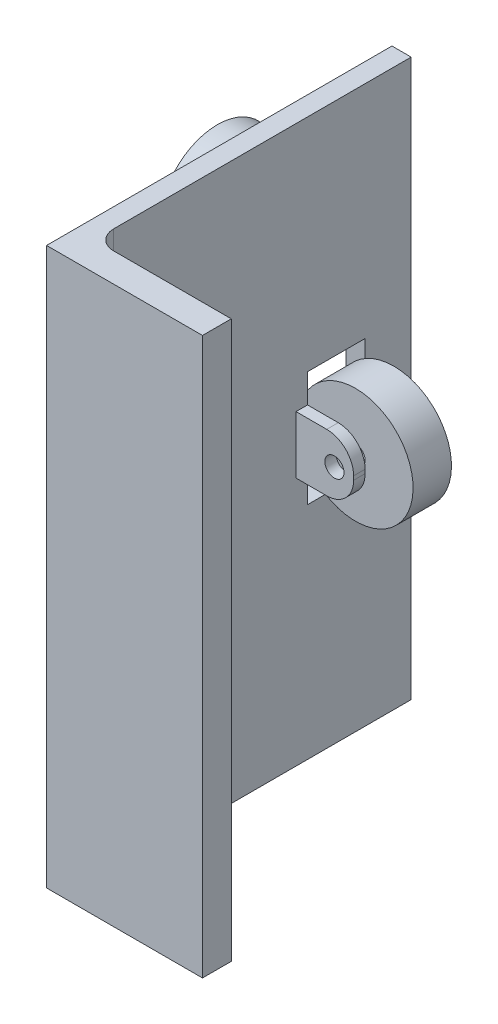
ISO-10303-21;
HEADER;
FILE_DESCRIPTION(('STEP AP214'),'2;1');
FILE_NAME('part.step','',(''),(''),'','','');
FILE_SCHEMA(('AUTOMOTIVE_DESIGN { 1 0 10303 214 1 1 1 1 }'));
ENDSEC;
DATA;
#1=APPLICATION_CONTEXT('core data for automotive mechanical design processes');
#2=APPLICATION_PROTOCOL_DEFINITION('international standard','automotive_design',2000,#1);
#3=PRODUCT_CONTEXT('',#1,'mechanical');
#4=PRODUCT('Part','Part','',(#3));
#5=PRODUCT_RELATED_PRODUCT_CATEGORY('part','',(#4));
#6=PRODUCT_DEFINITION_FORMATION('','',#4);
#7=PRODUCT_DEFINITION_CONTEXT('part definition',#1,'design');
#8=PRODUCT_DEFINITION('design','',#6,#7);
#9=PRODUCT_DEFINITION_SHAPE('','',#8);
#10=(LENGTH_UNIT() NAMED_UNIT(*) SI_UNIT(.MILLI.,.METRE.));
#11=(NAMED_UNIT(*) PLANE_ANGLE_UNIT() SI_UNIT($,.RADIAN.));
#12=(NAMED_UNIT(*) SI_UNIT($,.STERADIAN.) SOLID_ANGLE_UNIT());
#13=UNCERTAINTY_MEASURE_WITH_UNIT(LENGTH_MEASURE(1.E-05),#10,'distance_accuracy_value','');
#14=(GEOMETRIC_REPRESENTATION_CONTEXT(3) GLOBAL_UNCERTAINTY_ASSIGNED_CONTEXT((#13)) GLOBAL_UNIT_ASSIGNED_CONTEXT((#10,
#11,#12)) REPRESENTATION_CONTEXT('',''));
#15=CARTESIAN_POINT('',(0.,0.,0.));
#16=DIRECTION('',(0.,0.,1.));
#17=DIRECTION('',(1.,0.,0.));
#18=AXIS2_PLACEMENT_3D('',#15,#16,#17);
#19=CARTESIAN_POINT('',(15.,72.5,-75.5));
#20=DIRECTION('',(0.,0.,1.));
#21=DIRECTION('',(0.,-1.,0.));
#22=AXIS2_PLACEMENT_3D('',#19,#20,#21);
#23=CYLINDRICAL_SURFACE('',#22,15.);
#24=CARTESIAN_POINT('',(15.,72.5,-75.5));
#25=DIRECTION('',(0.,0.,-1.));
#26=DIRECTION('',(0.,1.,0.));
#27=AXIS2_PLACEMENT_3D('',#24,#25,#26);
#28=CIRCLE('',#27,15.);
#29=CARTESIAN_POINT('',(15.,87.5,-75.5));
#30=VERTEX_POINT('',#29);
#31=EDGE_CURVE('E11',#30,#30,#28,.T.);
#32=ORIENTED_EDGE('',*,*,#31,.F.);
#33=EDGE_LOOP('',(#32));
#34=FACE_BOUND('',#33,.T.);
#35=CARTESIAN_POINT('',(15.,72.5,-65.5));
#36=DIRECTION('',(0.,0.,-1.));
#37=DIRECTION('',(0.,1.,0.));
#38=AXIS2_PLACEMENT_3D('',#35,#36,#37);
#39=CIRCLE('',#38,15.);
#40=CARTESIAN_POINT('',(15.,87.5,-65.5));
#41=VERTEX_POINT('',#40);
#42=EDGE_CURVE('E47',#41,#41,#39,.T.);
#43=ORIENTED_EDGE('',*,*,#42,.T.);
#44=EDGE_LOOP('',(#43));
#45=FACE_BOUND('',#44,.T.);
#46=ADVANCED_FACE('F40',(#34,#45),#23,.T.);
#47=CARTESIAN_POINT('',(15.,72.5,-75.5));
#48=DIRECTION('',(0.,0.,-1.));
#49=DIRECTION('',(0.,1.,0.));
#50=AXIS2_PLACEMENT_3D('',#47,#48,#49);
#51=PLANE('',#50);
#52=CARTESIAN_POINT('',(15.,72.5,-75.5));
#53=DIRECTION('',(0.,0.,-1.));
#54=DIRECTION('',(0.,1.,0.));
#55=AXIS2_PLACEMENT_3D('',#52,#53,#54);
#56=CIRCLE('',#55,2.5);
#57=CARTESIAN_POINT('',(15.,75.,-75.5));
#58=VERTEX_POINT('',#57);
#59=EDGE_CURVE('E52',#58,#58,#56,.T.);
#60=ORIENTED_EDGE('',*,*,#59,.F.);
#61=EDGE_LOOP('',(#60));
#62=FACE_BOUND('',#61,.T.);
#63=ORIENTED_EDGE('',*,*,#31,.T.);
#64=EDGE_LOOP('',(#63));
#65=FACE_BOUND('',#64,.T.);
#66=ADVANCED_FACE('F69',(#62,#65),#51,.T.);
#67=CARTESIAN_POINT('',(15.,72.5,-65.5));
#68=DIRECTION('',(0.,0.,-1.));
#69=DIRECTION('',(0.,1.,0.));
#70=AXIS2_PLACEMENT_3D('',#67,#68,#69);
#71=PLANE('',#70);
#72=CARTESIAN_POINT('',(15.,72.5,-65.5));
#73=DIRECTION('',(0.,0.,-1.));
#74=DIRECTION('',(0.,1.,0.));
#75=AXIS2_PLACEMENT_3D('',#72,#73,#74);
#76=CIRCLE('',#75,2.5);
#77=CARTESIAN_POINT('',(15.,75.,-65.5));
#78=VERTEX_POINT('',#77);
#79=EDGE_CURVE('E43',#78,#78,#76,.T.);
#80=ORIENTED_EDGE('',*,*,#79,.T.);
#81=EDGE_LOOP('',(#80));
#82=FACE_BOUND('',#81,.T.);
#83=ORIENTED_EDGE('',*,*,#42,.F.);
#84=EDGE_LOOP('',(#83));
#85=FACE_BOUND('',#84,.T.);
#86=ADVANCED_FACE('F60',(#82,#85),#71,.F.);
#87=CARTESIAN_POINT('',(15.,72.5,-56.));
#88=DIRECTION('',(0.,0.,-1.));
#89=DIRECTION('',(-1.,0.,0.));
#90=AXIS2_PLACEMENT_3D('',#87,#88,#89);
#91=CYLINDRICAL_SURFACE('',#90,2.5);
#92=ORIENTED_EDGE('',*,*,#59,.T.);
#93=EDGE_LOOP('',(#92));
#94=FACE_BOUND('',#93,.T.);
#95=ORIENTED_EDGE('',*,*,#79,.F.);
#96=EDGE_LOOP('',(#95));
#97=FACE_BOUND('',#96,.T.);
#98=ADVANCED_FACE('F63',(#94,#97),#91,.F.);
#99=CLOSED_SHELL('',(#46,#66,#86,#98));
#100=MANIFOLD_SOLID_BREP('B2',#99);
#101=CARTESIAN_POINT('',(5.,145.,-90.));
#102=DIRECTION('',(-1.,0.,0.));
#103=DIRECTION('',(0.,0.,1.));
#104=AXIS2_PLACEMENT_3D('',#101,#102,#103);
#105=PLANE('',#104);
#106=DIRECTION('',(0.,0.,-1.));
#107=VECTOR('',#106,1.);
#108=CARTESIAN_POINT('',(5.,0.,-90.));
#109=LINE('',#108,#107);
#110=CARTESIAN_POINT('',(5.,0.,-12.5));
#111=VERTEX_POINT('',#110);
#112=CARTESIAN_POINT('',(5.,0.,-90.));
#113=VERTEX_POINT('',#112);
#114=EDGE_CURVE('E379',#111,#113,#109,.T.);
#115=ORIENTED_EDGE('',*,*,#114,.T.);
#116=DIRECTION('',(0.,-1.,0.));
#117=VECTOR('',#116,1.);
#118=CARTESIAN_POINT('',(5.,145.,-90.));
#119=LINE('',#118,#117);
#120=CARTESIAN_POINT('',(5.,145.,-90.));
#121=VERTEX_POINT('',#120);
#122=EDGE_CURVE('E389',#121,#113,#119,.T.);
#123=ORIENTED_EDGE('',*,*,#122,.F.);
#124=DIRECTION('',(0.,0.,-1.));
#125=VECTOR('',#124,1.);
#126=CARTESIAN_POINT('',(5.,145.,-90.));
#127=LINE('',#126,#125);
#128=CARTESIAN_POINT('',(5.,145.,-12.5));
#129=VERTEX_POINT('',#128);
#130=EDGE_CURVE('E364',#129,#121,#127,.T.);
#131=ORIENTED_EDGE('',*,*,#130,.F.);
#132=DIRECTION('',(0.,-1.,0.));
#133=VECTOR('',#132,1.);
#134=CARTESIAN_POINT('',(5.,145.,-12.5));
#135=LINE('',#134,#133);
#136=EDGE_CURVE('E392',#129,#111,#135,.T.);
#137=ORIENTED_EDGE('',*,*,#136,.T.);
#138=EDGE_LOOP('',(#115,#123,#131,#137));
#139=FACE_BOUND('',#138,.T.);
#140=DIRECTION('',(0.,0.,1.));
#141=VECTOR('',#140,1.);
#142=CARTESIAN_POINT('',(5.,80.,-78.));
#143=LINE('',#142,#141);
#144=CARTESIAN_POINT('',(5.,80.,-81.));
#145=VERTEX_POINT('',#144);
#146=CARTESIAN_POINT('',(5.,80.,-78.));
#147=VERTEX_POINT('',#146);
#148=EDGE_CURVE('E283',#145,#147,#143,.T.);
#149=ORIENTED_EDGE('',*,*,#148,.F.);
#150=DIRECTION('',(0.,1.,0.));
#151=VECTOR('',#150,1.);
#152=CARTESIAN_POINT('',(5.,80.,-81.));
#153=LINE('',#152,#151);
#154=CARTESIAN_POINT('',(5.,65.,-81.));
#155=VERTEX_POINT('',#154);
#156=EDGE_CURVE('E282',#155,#145,#153,.T.);
#157=ORIENTED_EDGE('',*,*,#156,.F.);
#158=DIRECTION('',(0.,0.,-1.));
#159=VECTOR('',#158,1.);
#160=CARTESIAN_POINT('',(5.,65.,-78.));
#161=LINE('',#160,#159);
#162=CARTESIAN_POINT('',(5.,65.,-78.));
#163=VERTEX_POINT('',#162);
#164=EDGE_CURVE('E260',#163,#155,#161,.T.);
#165=ORIENTED_EDGE('',*,*,#164,.F.);
#166=DIRECTION('',(0.,-1.,0.));
#167=VECTOR('',#166,1.);
#168=CARTESIAN_POINT('',(5.,145.,-78.0000000000001));
#169=LINE('',#168,#167);
#170=CARTESIAN_POINT('',(5.,57.5,-78.));
#171=VERTEX_POINT('',#170);
#172=EDGE_CURVE('E268',#163,#171,#169,.T.);
#173=ORIENTED_EDGE('',*,*,#172,.T.);
#174=DIRECTION('',(0.,0.,1.));
#175=VECTOR('',#174,1.);
#176=CARTESIAN_POINT('',(5.,57.5,-90.));
#177=LINE('',#176,#175);
#178=CARTESIAN_POINT('',(5.,57.5,-63.));
#179=VERTEX_POINT('',#178);
#180=EDGE_CURVE('E333',#171,#179,#177,.T.);
#181=ORIENTED_EDGE('',*,*,#180,.T.);
#182=DIRECTION('',(0.,1.,0.));
#183=VECTOR('',#182,1.);
#184=CARTESIAN_POINT('',(5.,145.,-63.));
#185=LINE('',#184,#183);
#186=CARTESIAN_POINT('',(5.,65.,-63.));
#187=VERTEX_POINT('',#186);
#188=EDGE_CURVE('E341',#179,#187,#185,.T.);
#189=ORIENTED_EDGE('',*,*,#188,.T.);
#190=DIRECTION('',(0.,0.,-1.));
#191=VECTOR('',#190,1.);
#192=CARTESIAN_POINT('',(5.,65.,-63.));
#193=LINE('',#192,#191);
#194=CARTESIAN_POINT('',(5.,65.,-60.));
#195=VERTEX_POINT('',#194);
#196=EDGE_CURVE('E302',#195,#187,#193,.T.);
#197=ORIENTED_EDGE('',*,*,#196,.F.);
#198=DIRECTION('',(0.,-1.,0.));
#199=VECTOR('',#198,1.);
#200=CARTESIAN_POINT('',(5.,80.,-60.));
#201=LINE('',#200,#199);
#202=CARTESIAN_POINT('',(5.,80.,-60.));
#203=VERTEX_POINT('',#202);
#204=EDGE_CURVE('E308',#203,#195,#201,.T.);
#205=ORIENTED_EDGE('',*,*,#204,.F.);
#206=DIRECTION('',(0.,0.,1.));
#207=VECTOR('',#206,1.);
#208=CARTESIAN_POINT('',(5.,80.,-63.));
#209=LINE('',#208,#207);
#210=CARTESIAN_POINT('',(5.,80.,-63.));
#211=VERTEX_POINT('',#210);
#212=EDGE_CURVE('E297',#211,#203,#209,.T.);
#213=ORIENTED_EDGE('',*,*,#212,.F.);
#214=CARTESIAN_POINT('',(5.,87.5,-63.));
#215=VERTEX_POINT('',#214);
#216=EDGE_CURVE('E340',#211,#215,#185,.T.);
#217=ORIENTED_EDGE('',*,*,#216,.T.);
#218=DIRECTION('',(0.,0.,-1.));
#219=VECTOR('',#218,1.);
#220=CARTESIAN_POINT('',(5.,87.5,-90.));
#221=LINE('',#220,#219);
#222=CARTESIAN_POINT('',(5.,87.5,-78.));
#223=VERTEX_POINT('',#222);
#224=EDGE_CURVE('E277',#215,#223,#221,.T.);
#225=ORIENTED_EDGE('',*,*,#224,.T.);
#226=EDGE_CURVE('E276',#223,#147,#169,.T.);
#227=ORIENTED_EDGE('',*,*,#226,.T.);
#228=EDGE_LOOP('',(#149,#157,#165,#173,#181,#189,#197,#205,#213,#217,#225,#227));
#229=FACE_BOUND('',#228,.T.);
#230=ADVANCED_FACE('F101',(#139,#229),#105,.F.);
#231=CARTESIAN_POINT('',(0.,145.,0.));
#232=DIRECTION('',(0.,0.,-1.));
#233=DIRECTION('',(-1.,0.,0.));
#234=AXIS2_PLACEMENT_3D('',#231,#232,#233);
#235=PLANE('',#234);
#236=DIRECTION('',(1.,0.,0.));
#237=VECTOR('',#236,1.);
#238=CARTESIAN_POINT('',(0.,0.,0.));
#239=LINE('',#238,#237);
#240=CARTESIAN_POINT('',(0.,0.,0.));
#241=VERTEX_POINT('',#240);
#242=CARTESIAN_POINT('',(40.625,0.,0.));
#243=VERTEX_POINT('',#242);
#244=EDGE_CURVE('E353',#241,#243,#239,.T.);
#245=ORIENTED_EDGE('',*,*,#244,.T.);
#246=DIRECTION('',(0.,-1.,0.));
#247=VECTOR('',#246,1.);
#248=CARTESIAN_POINT('',(40.625,145.,0.));
#249=LINE('',#248,#247);
#250=CARTESIAN_POINT('',(40.625,145.,0.));
#251=VERTEX_POINT('',#250);
#252=EDGE_CURVE('E401',#251,#243,#249,.T.);
#253=ORIENTED_EDGE('',*,*,#252,.F.);
#254=DIRECTION('',(1.,0.,0.));
#255=VECTOR('',#254,1.);
#256=CARTESIAN_POINT('',(0.,145.,0.));
#257=LINE('',#256,#255);
#258=CARTESIAN_POINT('',(0.,145.,0.));
#259=VERTEX_POINT('',#258);
#260=EDGE_CURVE('E354',#259,#251,#257,.T.);
#261=ORIENTED_EDGE('',*,*,#260,.F.);
#262=DIRECTION('',(0.,-1.,0.));
#263=VECTOR('',#262,1.);
#264=CARTESIAN_POINT('',(0.,145.,0.));
#265=LINE('',#264,#263);
#266=EDGE_CURVE('E370',#259,#241,#265,.T.);
#267=ORIENTED_EDGE('',*,*,#266,.T.);
#268=EDGE_LOOP('',(#245,#253,#261,#267));
#269=FACE_BOUND('',#268,.T.);
#270=ADVANCED_FACE('F478',(#269),#235,.F.);
#271=CARTESIAN_POINT('',(40.625,145.,0.));
#272=DIRECTION('',(-1.,0.,0.));
#273=DIRECTION('',(0.,0.,1.));
#274=AXIS2_PLACEMENT_3D('',#271,#272,#273);
#275=PLANE('',#274);
#276=DIRECTION('',(0.,0.,-1.));
#277=VECTOR('',#276,1.);
#278=CARTESIAN_POINT('',(40.625,0.,0.));
#279=LINE('',#278,#277);
#280=CARTESIAN_POINT('',(40.625,0.,-7.5));
#281=VERTEX_POINT('',#280);
#282=EDGE_CURVE('E373',#243,#281,#279,.T.);
#283=ORIENTED_EDGE('',*,*,#282,.T.);
#284=DIRECTION('',(0.,-1.,0.));
#285=VECTOR('',#284,1.);
#286=CARTESIAN_POINT('',(40.625,145.,-7.5));
#287=LINE('',#286,#285);
#288=CARTESIAN_POINT('',(40.625,145.,-7.5));
#289=VERTEX_POINT('',#288);
#290=EDGE_CURVE('E398',#289,#281,#287,.T.);
#291=ORIENTED_EDGE('',*,*,#290,.F.);
#292=DIRECTION('',(0.,0.,-1.));
#293=VECTOR('',#292,1.);
#294=CARTESIAN_POINT('',(40.625,145.,0.));
#295=LINE('',#294,#293);
#296=EDGE_CURVE('E357',#251,#289,#295,.T.);
#297=ORIENTED_EDGE('',*,*,#296,.F.);
#298=ORIENTED_EDGE('',*,*,#252,.T.);
#299=EDGE_LOOP('',(#283,#291,#297,#298));
#300=FACE_BOUND('',#299,.T.);
#301=ADVANCED_FACE('F484',(#300),#275,.F.);
#302=CARTESIAN_POINT('',(10.,145.,-7.5));
#303=DIRECTION('',(0.,0.,1.));
#304=DIRECTION('',(1.,0.,0.));
#305=AXIS2_PLACEMENT_3D('',#302,#303,#304);
#306=PLANE('',#305);
#307=DIRECTION('',(-1.,0.,0.));
#308=VECTOR('',#307,1.);
#309=CARTESIAN_POINT('',(10.,0.,-7.5));
#310=LINE('',#309,#308);
#311=CARTESIAN_POINT('',(10.,0.,-7.5));
#312=VERTEX_POINT('',#311);
#313=EDGE_CURVE('E375',#281,#312,#310,.T.);
#314=ORIENTED_EDGE('',*,*,#313,.T.);
#315=DIRECTION('',(0.,-1.,0.));
#316=VECTOR('',#315,1.);
#317=CARTESIAN_POINT('',(10.,145.,-7.5));
#318=LINE('',#317,#316);
#319=CARTESIAN_POINT('',(10.,145.,-7.5));
#320=VERTEX_POINT('',#319);
#321=EDGE_CURVE('E395',#320,#312,#318,.T.);
#322=ORIENTED_EDGE('',*,*,#321,.F.);
#323=DIRECTION('',(-1.,0.,0.));
#324=VECTOR('',#323,1.);
#325=CARTESIAN_POINT('',(10.,145.,-7.5));
#326=LINE('',#325,#324);
#327=EDGE_CURVE('E360',#289,#320,#326,.T.);
#328=ORIENTED_EDGE('',*,*,#327,.F.);
#329=ORIENTED_EDGE('',*,*,#290,.T.);
#330=EDGE_LOOP('',(#314,#322,#328,#329));
#331=FACE_BOUND('',#330,.T.);
#332=ADVANCED_FACE('F494',(#331),#306,.F.);
#333=CARTESIAN_POINT('',(10.,145.,-12.5));
#334=DIRECTION('',(0.,-1.,0.));
#335=DIRECTION('',(0.,0.,-1.));
#336=AXIS2_PLACEMENT_3D('',#333,#334,#335);
#337=CYLINDRICAL_SURFACE('',#336,5.);
#338=CARTESIAN_POINT('',(10.,0.,-12.5));
#339=DIRECTION('',(0.,-1.,0.));
#340=DIRECTION('',(0.,0.,1.));
#341=AXIS2_PLACEMENT_3D('',#338,#339,#340);
#342=CIRCLE('',#341,5.);
#343=EDGE_CURVE('E377',#312,#111,#342,.T.);
#344=ORIENTED_EDGE('',*,*,#343,.T.);
#345=ORIENTED_EDGE('',*,*,#136,.F.);
#346=CARTESIAN_POINT('',(10.,145.,-12.5));
#347=DIRECTION('',(0.,-1.,0.));
#348=DIRECTION('',(0.,0.,1.));
#349=AXIS2_PLACEMENT_3D('',#346,#347,#348);
#350=CIRCLE('',#349,5.);
#351=EDGE_CURVE('E362',#320,#129,#350,.T.);
#352=ORIENTED_EDGE('',*,*,#351,.F.);
#353=ORIENTED_EDGE('',*,*,#321,.T.);
#354=EDGE_LOOP('',(#344,#345,#352,#353));
#355=FACE_BOUND('',#354,.T.);
#356=ADVANCED_FACE('F491',(#355),#337,.F.);
#357=CARTESIAN_POINT('',(0.,145.,-90.));
#358=DIRECTION('',(0.,0.,1.));
#359=DIRECTION('',(1.,0.,0.));
#360=AXIS2_PLACEMENT_3D('',#357,#358,#359);
#361=PLANE('',#360);
#362=DIRECTION('',(-1.,0.,0.));
#363=VECTOR('',#362,1.);
#364=CARTESIAN_POINT('',(0.,0.,-90.));
#365=LINE('',#364,#363);
#366=CARTESIAN_POINT('',(0.,0.,-90.));
#367=VERTEX_POINT('',#366);
#368=EDGE_CURVE('E381',#113,#367,#365,.T.);
#369=ORIENTED_EDGE('',*,*,#368,.T.);
#370=DIRECTION('',(0.,-1.,0.));
#371=VECTOR('',#370,1.);
#372=CARTESIAN_POINT('',(0.,145.,-90.));
#373=LINE('',#372,#371);
#374=CARTESIAN_POINT('',(0.,145.,-90.));
#375=VERTEX_POINT('',#374);
#376=EDGE_CURVE('E386',#375,#367,#373,.T.);
#377=ORIENTED_EDGE('',*,*,#376,.F.);
#378=DIRECTION('',(-1.,0.,0.));
#379=VECTOR('',#378,1.);
#380=CARTESIAN_POINT('',(0.,145.,-90.));
#381=LINE('',#380,#379);
#382=EDGE_CURVE('E366',#121,#375,#381,.T.);
#383=ORIENTED_EDGE('',*,*,#382,.F.);
#384=ORIENTED_EDGE('',*,*,#122,.T.);
#385=EDGE_LOOP('',(#369,#377,#383,#384));
#386=FACE_BOUND('',#385,.T.);
#387=ADVANCED_FACE('F489',(#386),#361,.F.);
#388=CARTESIAN_POINT('',(0.,145.,0.));
#389=DIRECTION('',(1.,0.,0.));
#390=DIRECTION('',(0.,0.,-1.));
#391=AXIS2_PLACEMENT_3D('',#388,#389,#390);
#392=PLANE('',#391);
#393=DIRECTION('',(0.,0.,1.));
#394=VECTOR('',#393,1.);
#395=CARTESIAN_POINT('',(0.,57.5,-78.));
#396=LINE('',#395,#394);
#397=CARTESIAN_POINT('',(0.,57.5,-78.));
#398=VERTEX_POINT('',#397);
#399=CARTESIAN_POINT('',(0.,57.5,-63.));
#400=VERTEX_POINT('',#399);
#401=EDGE_CURVE('E322',#398,#400,#396,.T.);
#402=ORIENTED_EDGE('',*,*,#401,.F.);
#403=DIRECTION('',(0.,-1.,0.));
#404=VECTOR('',#403,1.);
#405=CARTESIAN_POINT('',(0.,87.5,-78.));
#406=LINE('',#405,#404);
#407=CARTESIAN_POINT('',(0.,87.5,-78.));
#408=VERTEX_POINT('',#407);
#409=EDGE_CURVE('E320',#408,#398,#406,.T.);
#410=ORIENTED_EDGE('',*,*,#409,.F.);
#411=DIRECTION('',(0.,0.,-1.));
#412=VECTOR('',#411,1.);
#413=CARTESIAN_POINT('',(0.,87.5,-78.));
#414=LINE('',#413,#412);
#415=CARTESIAN_POINT('',(0.,87.5,-63.));
#416=VERTEX_POINT('',#415);
#417=EDGE_CURVE('E328',#416,#408,#414,.T.);
#418=ORIENTED_EDGE('',*,*,#417,.F.);
#419=DIRECTION('',(0.,1.,0.));
#420=VECTOR('',#419,1.);
#421=CARTESIAN_POINT('',(0.,87.5,-63.));
#422=LINE('',#421,#420);
#423=EDGE_CURVE('E325',#400,#416,#422,.T.);
#424=ORIENTED_EDGE('',*,*,#423,.F.);
#425=EDGE_LOOP('',(#402,#410,#418,#424));
#426=FACE_BOUND('',#425,.T.);
#427=CARTESIAN_POINT('',(0.,20.,-54.5));
#428=DIRECTION('',(1.,0.,0.));
#429=DIRECTION('',(0.,0.,-1.));
#430=AXIS2_PLACEMENT_3D('',#427,#428,#429);
#431=CIRCLE('',#430,15.);
#432=CARTESIAN_POINT('',(0.,20.,-69.5));
#433=VERTEX_POINT('',#432);
#434=EDGE_CURVE('E407',#433,#433,#431,.F.);
#435=ORIENTED_EDGE('',*,*,#434,.F.);
#436=EDGE_LOOP('',(#435));
#437=FACE_BOUND('',#436,.T.);
#438=CARTESIAN_POINT('',(0.,125.,-54.5));
#439=DIRECTION('',(1.,0.,0.));
#440=DIRECTION('',(0.,0.,-1.));
#441=AXIS2_PLACEMENT_3D('',#438,#439,#440);
#442=CIRCLE('',#441,15.);
#443=CARTESIAN_POINT('',(0.,125.,-69.5));
#444=VERTEX_POINT('',#443);
#445=EDGE_CURVE('E404',#444,#444,#442,.F.);
#446=ORIENTED_EDGE('',*,*,#445,.F.);
#447=EDGE_LOOP('',(#446));
#448=FACE_BOUND('',#447,.T.);
#449=DIRECTION('',(0.,0.,1.));
#450=VECTOR('',#449,1.);
#451=CARTESIAN_POINT('',(0.,0.,0.));
#452=LINE('',#451,#450);
#453=EDGE_CURVE('E358',#367,#241,#452,.T.);
#454=ORIENTED_EDGE('',*,*,#453,.T.);
#455=ORIENTED_EDGE('',*,*,#266,.F.);
#456=DIRECTION('',(0.,0.,1.));
#457=VECTOR('',#456,1.);
#458=CARTESIAN_POINT('',(0.,145.,0.));
#459=LINE('',#458,#457);
#460=EDGE_CURVE('E368',#375,#259,#459,.T.);
#461=ORIENTED_EDGE('',*,*,#460,.F.);
#462=ORIENTED_EDGE('',*,*,#376,.T.);
#463=EDGE_LOOP('',(#454,#455,#461,#462));
#464=FACE_BOUND('',#463,.T.);
#465=ADVANCED_FACE('F567',(#426,#437,#448,#464),#392,.F.);
#466=CARTESIAN_POINT('',(10.,145.,-12.5));
#467=DIRECTION('',(0.,1.,0.));
#468=DIRECTION('',(0.,0.,1.));
#469=AXIS2_PLACEMENT_3D('',#466,#467,#468);
#470=PLANE('',#469);
#471=ORIENTED_EDGE('',*,*,#260,.T.);
#472=ORIENTED_EDGE('',*,*,#296,.T.);
#473=ORIENTED_EDGE('',*,*,#327,.T.);
#474=ORIENTED_EDGE('',*,*,#351,.T.);
#475=ORIENTED_EDGE('',*,*,#130,.T.);
#476=ORIENTED_EDGE('',*,*,#382,.T.);
#477=ORIENTED_EDGE('',*,*,#460,.T.);
#478=EDGE_LOOP('',(#471,#472,#473,#474,#475,#476,#477));
#479=FACE_BOUND('',#478,.T.);
#480=ADVANCED_FACE('F598',(#479),#470,.T.);
#481=CARTESIAN_POINT('',(10.,0.,-12.5));
#482=DIRECTION('',(0.,1.,0.));
#483=DIRECTION('',(0.,0.,1.));
#484=AXIS2_PLACEMENT_3D('',#481,#482,#483);
#485=PLANE('',#484);
#486=ORIENTED_EDGE('',*,*,#244,.F.);
#487=ORIENTED_EDGE('',*,*,#453,.F.);
#488=ORIENTED_EDGE('',*,*,#368,.F.);
#489=ORIENTED_EDGE('',*,*,#114,.F.);
#490=ORIENTED_EDGE('',*,*,#343,.F.);
#491=ORIENTED_EDGE('',*,*,#313,.F.);
#492=ORIENTED_EDGE('',*,*,#282,.F.);
#493=EDGE_LOOP('',(#486,#487,#488,#489,#490,#491,#492));
#494=FACE_BOUND('',#493,.T.);
#495=ADVANCED_FACE('F596',(#494),#485,.F.);
#496=CARTESIAN_POINT('',(-10.,125.,-54.5));
#497=DIRECTION('',(1.,0.,0.));
#498=DIRECTION('',(0.,0.,-1.));
#499=AXIS2_PLACEMENT_3D('',#496,#497,#498);
#500=CYLINDRICAL_SURFACE('',#499,15.);
#501=CARTESIAN_POINT('',(-10.,125.,-54.5));
#502=DIRECTION('',(-1.,0.,0.));
#503=DIRECTION('',(0.,0.,1.));
#504=AXIS2_PLACEMENT_3D('',#501,#502,#503);
#505=CIRCLE('',#504,15.);
#506=CARTESIAN_POINT('',(-10.,125.,-39.5));
#507=VERTEX_POINT('',#506);
#508=EDGE_CURVE('E350',#507,#507,#505,.T.);
#509=ORIENTED_EDGE('',*,*,#508,.F.);
#510=EDGE_LOOP('',(#509));
#511=FACE_BOUND('',#510,.T.);
#512=ORIENTED_EDGE('',*,*,#445,.T.);
#513=EDGE_LOOP('',(#512));
#514=FACE_BOUND('',#513,.T.);
#515=ADVANCED_FACE('F592',(#511,#514),#500,.T.);
#516=CARTESIAN_POINT('',(-10.,125.,-54.5));
#517=DIRECTION('',(-1.,0.,0.));
#518=DIRECTION('',(0.,0.,1.));
#519=AXIS2_PLACEMENT_3D('',#516,#517,#518);
#520=PLANE('',#519);
#521=ORIENTED_EDGE('',*,*,#508,.T.);
#522=EDGE_LOOP('',(#521));
#523=FACE_BOUND('',#522,.T.);
#524=ADVANCED_FACE('F588',(#523),#520,.T.);
#525=CARTESIAN_POINT('',(-10.,20.,-54.5));
#526=DIRECTION('',(1.,0.,0.));
#527=DIRECTION('',(0.,0.,-1.));
#528=AXIS2_PLACEMENT_3D('',#525,#526,#527);
#529=CYLINDRICAL_SURFACE('',#528,15.);
#530=CARTESIAN_POINT('',(-10.,20.,-54.5));
#531=DIRECTION('',(-1.,0.,0.));
#532=DIRECTION('',(0.,0.,-1.));
#533=AXIS2_PLACEMENT_3D('',#530,#531,#532);
#534=CIRCLE('',#533,15.);
#535=CARTESIAN_POINT('',(-10.,20.,-69.5));
#536=VERTEX_POINT('',#535);
#537=EDGE_CURVE('E347',#536,#536,#534,.T.);
#538=ORIENTED_EDGE('',*,*,#537,.F.);
#539=EDGE_LOOP('',(#538));
#540=FACE_BOUND('',#539,.T.);
#541=ORIENTED_EDGE('',*,*,#434,.T.);
#542=EDGE_LOOP('',(#541));
#543=FACE_BOUND('',#542,.T.);
#544=ADVANCED_FACE('F584',(#540,#543),#529,.T.);
#545=CARTESIAN_POINT('',(-10.,20.,-54.5));
#546=DIRECTION('',(1.,0.,0.));
#547=DIRECTION('',(0.,0.,-1.));
#548=AXIS2_PLACEMENT_3D('',#545,#546,#547);
#549=PLANE('',#548);
#550=ORIENTED_EDGE('',*,*,#537,.T.);
#551=EDGE_LOOP('',(#550));
#552=FACE_BOUND('',#551,.T.);
#553=ADVANCED_FACE('F580',(#552),#549,.F.);
#554=CARTESIAN_POINT('',(10.,87.5,-78.));
#555=DIRECTION('',(0.,0.,-1.));
#556=DIRECTION('',(0.,1.,0.));
#557=AXIS2_PLACEMENT_3D('',#554,#555,#556);
#558=PLANE('',#557);
#559=CARTESIAN_POINT('',(15.,72.5,-78.));
#560=DIRECTION('',(0.,0.,-1.));
#561=DIRECTION('',(0.,1.,0.));
#562=AXIS2_PLACEMENT_3D('',#559,#560,#561);
#563=CIRCLE('',#562,2.5);
#564=CARTESIAN_POINT('',(15.,75.,-78.));
#565=VERTEX_POINT('',#564);
#566=EDGE_CURVE('E288',#565,#565,#563,.T.);
#567=ORIENTED_EDGE('',*,*,#566,.T.);
#568=EDGE_LOOP('',(#567));
#569=FACE_BOUND('',#568,.T.);
#570=DIRECTION('',(0.,-1.,0.));
#571=VECTOR('',#570,1.);
#572=CARTESIAN_POINT('',(20.,80.,-78.));
#573=LINE('',#572,#571);
#574=CARTESIAN_POINT('',(20.,73.,-78.));
#575=VERTEX_POINT('',#574);
#576=CARTESIAN_POINT('',(20.,72.,-78.));
#577=VERTEX_POINT('',#576);
#578=EDGE_CURVE('E285',#575,#577,#573,.T.);
#579=ORIENTED_EDGE('',*,*,#578,.F.);
#580=CARTESIAN_POINT('',(13.,73.,-78.));
#581=DIRECTION('',(0.,0.,-1.));
#582=DIRECTION('',(0.,1.,0.));
#583=AXIS2_PLACEMENT_3D('',#580,#581,#582);
#584=CIRCLE('',#583,7.);
#585=CARTESIAN_POINT('',(13.,80.,-78.));
#586=VERTEX_POINT('',#585);
#587=EDGE_CURVE('E436',#575,#586,#584,.F.);
#588=ORIENTED_EDGE('',*,*,#587,.T.);
#589=DIRECTION('',(-1.,0.,0.));
#590=VECTOR('',#589,1.);
#591=CARTESIAN_POINT('',(20.,80.,-78.));
#592=LINE('',#591,#590);
#593=EDGE_CURVE('E264',#586,#147,#592,.T.);
#594=ORIENTED_EDGE('',*,*,#593,.T.);
#595=ORIENTED_EDGE('',*,*,#226,.F.);
#596=DIRECTION('',(-1.,0.,0.));
#597=VECTOR('',#596,1.);
#598=CARTESIAN_POINT('',(10.,87.5,-78.));
#599=LINE('',#598,#597);
#600=EDGE_CURVE('E331',#223,#408,#599,.T.);
#601=ORIENTED_EDGE('',*,*,#600,.T.);
#602=ORIENTED_EDGE('',*,*,#409,.T.);
#603=DIRECTION('',(-1.,0.,0.));
#604=VECTOR('',#603,1.);
#605=CARTESIAN_POINT('',(10.,57.5,-78.));
#606=LINE('',#605,#604);
#607=EDGE_CURVE('E272',#171,#398,#606,.T.);
#608=ORIENTED_EDGE('',*,*,#607,.F.);
#609=ORIENTED_EDGE('',*,*,#172,.F.);
#610=DIRECTION('',(-1.,0.,0.));
#611=VECTOR('',#610,1.);
#612=CARTESIAN_POINT('',(20.,65.,-78.));
#613=LINE('',#612,#611);
#614=CARTESIAN_POINT('',(13.,65.,-78.));
#615=VERTEX_POINT('',#614);
#616=EDGE_CURVE('E256',#615,#163,#613,.T.);
#617=ORIENTED_EDGE('',*,*,#616,.F.);
#618=CARTESIAN_POINT('',(13.,72.,-78.));
#619=DIRECTION('',(0.,0.,-1.));
#620=DIRECTION('',(0.,1.,0.));
#621=AXIS2_PLACEMENT_3D('',#618,#619,#620);
#622=CIRCLE('',#621,7.);
#623=EDGE_CURVE('E434',#615,#577,#622,.F.);
#624=ORIENTED_EDGE('',*,*,#623,.T.);
#625=EDGE_LOOP('',(#579,#588,#594,#595,#601,#602,#608,#609,#617,#624));
#626=FACE_BOUND('',#625,.T.);
#627=ADVANCED_FACE('F270',(#569,#626),#558,.F.);
#628=CARTESIAN_POINT('',(10.,87.5,-78.));
#629=DIRECTION('',(0.,1.,0.));
#630=DIRECTION('',(0.,0.,1.));
#631=AXIS2_PLACEMENT_3D('',#628,#629,#630);
#632=PLANE('',#631);
#633=DIRECTION('',(-1.,0.,0.));
#634=VECTOR('',#633,1.);
#635=CARTESIAN_POINT('',(10.,87.5,-63.));
#636=LINE('',#635,#634);
#637=EDGE_CURVE('E334',#215,#416,#636,.T.);
#638=ORIENTED_EDGE('',*,*,#637,.T.);
#639=ORIENTED_EDGE('',*,*,#417,.T.);
#640=ORIENTED_EDGE('',*,*,#600,.F.);
#641=ORIENTED_EDGE('',*,*,#224,.F.);
#642=EDGE_LOOP('',(#638,#639,#640,#641));
#643=FACE_BOUND('',#642,.T.);
#644=ADVANCED_FACE('F531',(#643),#632,.F.);
#645=CARTESIAN_POINT('',(10.,87.5,-63.));
#646=DIRECTION('',(0.,0.,1.));
#647=DIRECTION('',(0.,-1.,0.));
#648=AXIS2_PLACEMENT_3D('',#645,#646,#647);
#649=PLANE('',#648);
#650=CARTESIAN_POINT('',(15.,72.5,-63.));
#651=DIRECTION('',(0.,0.,1.));
#652=DIRECTION('',(0.,-1.,0.));
#653=AXIS2_PLACEMENT_3D('',#650,#651,#652);
#654=CIRCLE('',#653,2.5);
#655=CARTESIAN_POINT('',(15.,70.,-63.));
#656=VERTEX_POINT('',#655);
#657=EDGE_CURVE('E455',#656,#656,#654,.T.);
#658=ORIENTED_EDGE('',*,*,#657,.T.);
#659=EDGE_LOOP('',(#658));
#660=FACE_BOUND('',#659,.T.);
#661=DIRECTION('',(-1.,0.,0.));
#662=VECTOR('',#661,1.);
#663=CARTESIAN_POINT('',(20.,80.,-63.));
#664=LINE('',#663,#662);
#665=CARTESIAN_POINT('',(13.,80.,-63.));
#666=VERTEX_POINT('',#665);
#667=EDGE_CURVE('E318',#666,#211,#664,.T.);
#668=ORIENTED_EDGE('',*,*,#667,.F.);
#669=CARTESIAN_POINT('',(13.,73.,-63.));
#670=DIRECTION('',(0.,0.,1.));
#671=DIRECTION('',(0.,-1.,0.));
#672=AXIS2_PLACEMENT_3D('',#669,#670,#671);
#673=CIRCLE('',#672,7.);
#674=CARTESIAN_POINT('',(20.,73.,-63.));
#675=VERTEX_POINT('',#674);
#676=EDGE_CURVE('E424',#666,#675,#673,.F.);
#677=ORIENTED_EDGE('',*,*,#676,.T.);
#678=DIRECTION('',(0.,1.,0.));
#679=VECTOR('',#678,1.);
#680=CARTESIAN_POINT('',(20.,80.,-63.));
#681=LINE('',#680,#679);
#682=CARTESIAN_POINT('',(20.,72.,-63.));
#683=VERTEX_POINT('',#682);
#684=EDGE_CURVE('E298',#683,#675,#681,.T.);
#685=ORIENTED_EDGE('',*,*,#684,.F.);
#686=CARTESIAN_POINT('',(13.,72.,-63.));
#687=DIRECTION('',(0.,0.,1.));
#688=DIRECTION('',(0.,-1.,0.));
#689=AXIS2_PLACEMENT_3D('',#686,#687,#688);
#690=CIRCLE('',#689,7.);
#691=CARTESIAN_POINT('',(13.,65.,-63.));
#692=VERTEX_POINT('',#691);
#693=EDGE_CURVE('E422',#683,#692,#690,.F.);
#694=ORIENTED_EDGE('',*,*,#693,.T.);
#695=DIRECTION('',(-1.,0.,0.));
#696=VECTOR('',#695,1.);
#697=CARTESIAN_POINT('',(20.,65.,-63.));
#698=LINE('',#697,#696);
#699=EDGE_CURVE('E305',#692,#187,#698,.T.);
#700=ORIENTED_EDGE('',*,*,#699,.T.);
#701=ORIENTED_EDGE('',*,*,#188,.F.);
#702=DIRECTION('',(-1.,0.,0.));
#703=VECTOR('',#702,1.);
#704=CARTESIAN_POINT('',(10.,57.5,-63.));
#705=LINE('',#704,#703);
#706=EDGE_CURVE('E336',#179,#400,#705,.T.);
#707=ORIENTED_EDGE('',*,*,#706,.T.);
#708=ORIENTED_EDGE('',*,*,#423,.T.);
#709=ORIENTED_EDGE('',*,*,#637,.F.);
#710=ORIENTED_EDGE('',*,*,#216,.F.);
#711=EDGE_LOOP('',(#668,#677,#685,#694,#700,#701,#707,#708,#709,#710));
#712=FACE_BOUND('',#711,.T.);
#713=ADVANCED_FACE('F527',(#660,#712),#649,.F.);
#714=CARTESIAN_POINT('',(10.,57.5,-78.));
#715=DIRECTION('',(0.,-1.,0.));
#716=DIRECTION('',(0.,0.,-1.));
#717=AXIS2_PLACEMENT_3D('',#714,#715,#716);
#718=PLANE('',#717);
#719=ORIENTED_EDGE('',*,*,#607,.T.);
#720=ORIENTED_EDGE('',*,*,#401,.T.);
#721=ORIENTED_EDGE('',*,*,#706,.F.);
#722=ORIENTED_EDGE('',*,*,#180,.F.);
#723=EDGE_LOOP('',(#719,#720,#721,#722));
#724=FACE_BOUND('',#723,.T.);
#725=ADVANCED_FACE('F530',(#724),#718,.F.);
#726=CARTESIAN_POINT('',(20.,80.,-63.));
#727=DIRECTION('',(0.,-1.,0.));
#728=DIRECTION('',(0.,0.,-1.));
#729=AXIS2_PLACEMENT_3D('',#726,#727,#728);
#730=PLANE('',#729);
#731=DIRECTION('',(-1.,0.,0.));
#732=VECTOR('',#731,1.);
#733=CARTESIAN_POINT('',(20.,80.,-60.));
#734=LINE('',#733,#732);
#735=CARTESIAN_POINT('',(13.,80.,-60.));
#736=VERTEX_POINT('',#735);
#737=EDGE_CURVE('E316',#736,#203,#734,.T.);
#738=ORIENTED_EDGE('',*,*,#737,.F.);
#739=DIRECTION('',(0.,0.,1.));
#740=VECTOR('',#739,1.);
#741=CARTESIAN_POINT('',(13.,80.,-63.));
#742=LINE('',#741,#740);
#743=EDGE_CURVE('E420',#736,#666,#742,.F.);
#744=ORIENTED_EDGE('',*,*,#743,.T.);
#745=ORIENTED_EDGE('',*,*,#667,.T.);
#746=ORIENTED_EDGE('',*,*,#212,.T.);
#747=EDGE_LOOP('',(#738,#744,#745,#746));
#748=FACE_BOUND('',#747,.T.);
#749=ADVANCED_FACE('F558',(#748),#730,.F.);
#750=CARTESIAN_POINT('',(20.,80.,-60.));
#751=DIRECTION('',(0.,0.,-1.));
#752=DIRECTION('',(-1.,0.,0.));
#753=AXIS2_PLACEMENT_3D('',#750,#751,#752);
#754=PLANE('',#753);
#755=CARTESIAN_POINT('',(15.,72.5,-60.));
#756=DIRECTION('',(0.,0.,-1.));
#757=DIRECTION('',(-1.,0.,0.));
#758=AXIS2_PLACEMENT_3D('',#755,#756,#757);
#759=CIRCLE('',#758,2.5);
#760=CARTESIAN_POINT('',(12.5,72.5,-60.));
#761=VERTEX_POINT('',#760);
#762=EDGE_CURVE('E458',#761,#761,#759,.T.);
#763=ORIENTED_EDGE('',*,*,#762,.T.);
#764=EDGE_LOOP('',(#763));
#765=FACE_BOUND('',#764,.T.);
#766=DIRECTION('',(0.,-1.,0.));
#767=VECTOR('',#766,1.);
#768=CARTESIAN_POINT('',(20.,80.,-60.));
#769=LINE('',#768,#767);
#770=CARTESIAN_POINT('',(20.,73.,-60.));
#771=VERTEX_POINT('',#770);
#772=CARTESIAN_POINT('',(20.,72.,-60.));
#773=VERTEX_POINT('',#772);
#774=EDGE_CURVE('E301',#771,#773,#769,.T.);
#775=ORIENTED_EDGE('',*,*,#774,.F.);
#776=CARTESIAN_POINT('',(13.,73.,-60.));
#777=DIRECTION('',(0.,0.,-1.));
#778=DIRECTION('',(-1.,0.,0.));
#779=AXIS2_PLACEMENT_3D('',#776,#777,#778);
#780=CIRCLE('',#779,7.);
#781=EDGE_CURVE('E418',#771,#736,#780,.F.);
#782=ORIENTED_EDGE('',*,*,#781,.T.);
#783=ORIENTED_EDGE('',*,*,#737,.T.);
#784=ORIENTED_EDGE('',*,*,#204,.T.);
#785=DIRECTION('',(-1.,0.,0.));
#786=VECTOR('',#785,1.);
#787=CARTESIAN_POINT('',(20.,65.,-60.));
#788=LINE('',#787,#786);
#789=CARTESIAN_POINT('',(13.,65.,-60.));
#790=VERTEX_POINT('',#789);
#791=EDGE_CURVE('E314',#790,#195,#788,.T.);
#792=ORIENTED_EDGE('',*,*,#791,.F.);
#793=CARTESIAN_POINT('',(13.,72.,-60.));
#794=DIRECTION('',(0.,0.,-1.));
#795=DIRECTION('',(-1.,0.,0.));
#796=AXIS2_PLACEMENT_3D('',#793,#794,#795);
#797=CIRCLE('',#796,7.);
#798=EDGE_CURVE('E416',#790,#773,#797,.F.);
#799=ORIENTED_EDGE('',*,*,#798,.T.);
#800=EDGE_LOOP('',(#775,#782,#783,#784,#792,#799));
#801=FACE_BOUND('',#800,.T.);
#802=ADVANCED_FACE('F547',(#765,#801),#754,.F.);
#803=CARTESIAN_POINT('',(20.,65.,-63.));
#804=DIRECTION('',(0.,1.,0.));
#805=DIRECTION('',(0.,0.,1.));
#806=AXIS2_PLACEMENT_3D('',#803,#804,#805);
#807=PLANE('',#806);
#808=ORIENTED_EDGE('',*,*,#699,.F.);
#809=DIRECTION('',(0.,0.,-1.));
#810=VECTOR('',#809,1.);
#811=CARTESIAN_POINT('',(13.,65.,-63.));
#812=LINE('',#811,#810);
#813=EDGE_CURVE('E426',#692,#790,#812,.F.);
#814=ORIENTED_EDGE('',*,*,#813,.T.);
#815=ORIENTED_EDGE('',*,*,#791,.T.);
#816=ORIENTED_EDGE('',*,*,#196,.T.);
#817=EDGE_LOOP('',(#808,#814,#815,#816));
#818=FACE_BOUND('',#817,.T.);
#819=ADVANCED_FACE('F555',(#818),#807,.F.);
#820=CARTESIAN_POINT('',(20.,0.,0.));
#821=DIRECTION('',(-1.,0.,0.));
#822=DIRECTION('',(0.,0.,1.));
#823=AXIS2_PLACEMENT_3D('',#820,#821,#822);
#824=PLANE('',#823);
#825=ORIENTED_EDGE('',*,*,#684,.T.);
#826=DIRECTION('',(0.,0.,1.));
#827=VECTOR('',#826,1.);
#828=CARTESIAN_POINT('',(20.,72.9999999999997,3.37021330795148E-13));
#829=LINE('',#828,#827);
#830=EDGE_CURVE('E413',#675,#771,#829,.T.);
#831=ORIENTED_EDGE('',*,*,#830,.T.);
#832=ORIENTED_EDGE('',*,*,#774,.T.);
#833=DIRECTION('',(0.,0.,-1.));
#834=VECTOR('',#833,1.);
#835=CARTESIAN_POINT('',(20.,72.,0.));
#836=LINE('',#835,#834);
#837=EDGE_CURVE('E410',#773,#683,#836,.T.);
#838=ORIENTED_EDGE('',*,*,#837,.T.);
#839=EDGE_LOOP('',(#825,#831,#832,#838));
#840=FACE_BOUND('',#839,.T.);
#841=ADVANCED_FACE('F544',(#840),#824,.F.);
#842=CARTESIAN_POINT('',(20.,80.,-78.));
#843=DIRECTION('',(0.,-1.,0.));
#844=DIRECTION('',(0.,0.,-1.));
#845=AXIS2_PLACEMENT_3D('',#842,#843,#844);
#846=PLANE('',#845);
#847=ORIENTED_EDGE('',*,*,#593,.F.);
#848=DIRECTION('',(0.,0.,1.));
#849=VECTOR('',#848,1.);
#850=CARTESIAN_POINT('',(13.,80.,-78.));
#851=LINE('',#850,#849);
#852=CARTESIAN_POINT('',(13.,80.,-81.));
#853=VERTEX_POINT('',#852);
#854=EDGE_CURVE('E124',#586,#853,#851,.F.);
#855=ORIENTED_EDGE('',*,*,#854,.T.);
#856=DIRECTION('',(-1.,0.,0.));
#857=VECTOR('',#856,1.);
#858=CARTESIAN_POINT('',(20.,80.,-81.));
#859=LINE('',#858,#857);
#860=EDGE_CURVE('E292',#853,#145,#859,.T.);
#861=ORIENTED_EDGE('',*,*,#860,.T.);
#862=ORIENTED_EDGE('',*,*,#148,.T.);
#863=EDGE_LOOP('',(#847,#855,#861,#862));
#864=FACE_BOUND('',#863,.T.);
#865=ADVANCED_FACE('F449',(#864),#846,.F.);
#866=CARTESIAN_POINT('',(20.,65.,-78.));
#867=DIRECTION('',(0.,1.,0.));
#868=DIRECTION('',(0.,0.,1.));
#869=AXIS2_PLACEMENT_3D('',#866,#867,#868);
#870=PLANE('',#869);
#871=DIRECTION('',(-1.,0.,0.));
#872=VECTOR('',#871,1.);
#873=CARTESIAN_POINT('',(20.,65.,-81.));
#874=LINE('',#873,#872);
#875=CARTESIAN_POINT('',(13.,65.,-81.));
#876=VERTEX_POINT('',#875);
#877=EDGE_CURVE('E265',#876,#155,#874,.T.);
#878=ORIENTED_EDGE('',*,*,#877,.F.);
#879=DIRECTION('',(0.,0.,-1.));
#880=VECTOR('',#879,1.);
#881=CARTESIAN_POINT('',(13.,65.,-78.));
#882=LINE('',#881,#880);
#883=EDGE_CURVE('E38',#876,#615,#882,.F.);
#884=ORIENTED_EDGE('',*,*,#883,.T.);
#885=ORIENTED_EDGE('',*,*,#616,.T.);
#886=ORIENTED_EDGE('',*,*,#164,.T.);
#887=EDGE_LOOP('',(#878,#884,#885,#886));
#888=FACE_BOUND('',#887,.T.);
#889=ADVANCED_FACE('F258',(#888),#870,.F.);
#890=CARTESIAN_POINT('',(20.,80.,-81.));
#891=DIRECTION('',(0.,0.,1.));
#892=DIRECTION('',(1.,0.,0.));
#893=AXIS2_PLACEMENT_3D('',#890,#891,#892);
#894=PLANE('',#893);
#895=CARTESIAN_POINT('',(15.,72.5,-81.));
#896=DIRECTION('',(0.,0.,-1.));
#897=DIRECTION('',(-1.,0.,0.));
#898=AXIS2_PLACEMENT_3D('',#895,#896,#897);
#899=CIRCLE('',#898,2.5);
#900=CARTESIAN_POINT('',(12.5,72.5,-81.));
#901=VERTEX_POINT('',#900);
#902=EDGE_CURVE('E461',#901,#901,#899,.T.);
#903=ORIENTED_EDGE('',*,*,#902,.F.);
#904=EDGE_LOOP('',(#903));
#905=FACE_BOUND('',#904,.T.);
#906=ORIENTED_EDGE('',*,*,#860,.F.);
#907=CARTESIAN_POINT('',(13.,73.,-81.));
#908=DIRECTION('',(0.,0.,1.));
#909=DIRECTION('',(1.,0.,0.));
#910=AXIS2_PLACEMENT_3D('',#907,#908,#909);
#911=CIRCLE('',#910,7.);
#912=CARTESIAN_POINT('',(20.,73.,-81.));
#913=VERTEX_POINT('',#912);
#914=EDGE_CURVE('E109',#853,#913,#911,.F.);
#915=ORIENTED_EDGE('',*,*,#914,.T.);
#916=DIRECTION('',(0.,1.,0.));
#917=VECTOR('',#916,1.);
#918=CARTESIAN_POINT('',(20.,80.,-81.));
#919=LINE('',#918,#917);
#920=CARTESIAN_POINT('',(20.,72.,-81.));
#921=VERTEX_POINT('',#920);
#922=EDGE_CURVE('E294',#921,#913,#919,.T.);
#923=ORIENTED_EDGE('',*,*,#922,.F.);
#924=CARTESIAN_POINT('',(13.,72.,-81.));
#925=DIRECTION('',(0.,0.,1.));
#926=DIRECTION('',(1.,0.,0.));
#927=AXIS2_PLACEMENT_3D('',#924,#925,#926);
#928=CIRCLE('',#927,7.);
#929=EDGE_CURVE('E116',#921,#876,#928,.F.);
#930=ORIENTED_EDGE('',*,*,#929,.T.);
#931=ORIENTED_EDGE('',*,*,#877,.T.);
#932=ORIENTED_EDGE('',*,*,#156,.T.);
#933=EDGE_LOOP('',(#906,#915,#923,#930,#931,#932));
#934=FACE_BOUND('',#933,.T.);
#935=ADVANCED_FACE('F441',(#905,#934),#894,.F.);
#936=CARTESIAN_POINT('',(20.,0.,0.));
#937=DIRECTION('',(-1.,0.,0.));
#938=DIRECTION('',(0.,0.,1.));
#939=AXIS2_PLACEMENT_3D('',#936,#937,#938);
#940=PLANE('',#939);
#941=ORIENTED_EDGE('',*,*,#922,.T.);
#942=DIRECTION('',(0.,0.,1.));
#943=VECTOR('',#942,1.);
#944=CARTESIAN_POINT('',(20.,73.,0.));
#945=LINE('',#944,#943);
#946=EDGE_CURVE('E431',#913,#575,#945,.T.);
#947=ORIENTED_EDGE('',*,*,#946,.T.);
#948=ORIENTED_EDGE('',*,*,#578,.T.);
#949=DIRECTION('',(0.,0.,-1.));
#950=VECTOR('',#949,1.);
#951=CARTESIAN_POINT('',(20.,72.,0.));
#952=LINE('',#951,#950);
#953=EDGE_CURVE('E428',#577,#921,#952,.T.);
#954=ORIENTED_EDGE('',*,*,#953,.T.);
#955=EDGE_LOOP('',(#941,#947,#948,#954));
#956=FACE_BOUND('',#955,.T.);
#957=ADVANCED_FACE('F445',(#956),#940,.F.);
#958=CARTESIAN_POINT('',(13.,72.9999999999997,3.37021330795148E-13));
#959=DIRECTION('',(0.,0.,1.));
#960=DIRECTION('',(0.,-1.,0.));
#961=AXIS2_PLACEMENT_3D('',#958,#959,#960);
#962=CYLINDRICAL_SURFACE('',#961,7.);
#963=ORIENTED_EDGE('',*,*,#676,.F.);
#964=ORIENTED_EDGE('',*,*,#743,.F.);
#965=ORIENTED_EDGE('',*,*,#781,.F.);
#966=ORIENTED_EDGE('',*,*,#830,.F.);
#967=EDGE_LOOP('',(#963,#964,#965,#966));
#968=FACE_BOUND('',#967,.T.);
#969=ADVANCED_FACE('F474',(#968),#962,.T.);
#970=CARTESIAN_POINT('',(13.,72.,0.));
#971=DIRECTION('',(0.,0.,-1.));
#972=DIRECTION('',(-1.,0.,0.));
#973=AXIS2_PLACEMENT_3D('',#970,#971,#972);
#974=CYLINDRICAL_SURFACE('',#973,7.);
#975=ORIENTED_EDGE('',*,*,#798,.F.);
#976=ORIENTED_EDGE('',*,*,#813,.F.);
#977=ORIENTED_EDGE('',*,*,#693,.F.);
#978=ORIENTED_EDGE('',*,*,#837,.F.);
#979=EDGE_LOOP('',(#975,#976,#977,#978));
#980=FACE_BOUND('',#979,.T.);
#981=ADVANCED_FACE('F504',(#980),#974,.T.);
#982=CARTESIAN_POINT('',(13.,73.,0.));
#983=DIRECTION('',(0.,0.,1.));
#984=DIRECTION('',(1.,0.,0.));
#985=AXIS2_PLACEMENT_3D('',#982,#983,#984);
#986=CYLINDRICAL_SURFACE('',#985,7.);
#987=ORIENTED_EDGE('',*,*,#914,.F.);
#988=ORIENTED_EDGE('',*,*,#854,.F.);
#989=ORIENTED_EDGE('',*,*,#587,.F.);
#990=ORIENTED_EDGE('',*,*,#946,.F.);
#991=EDGE_LOOP('',(#987,#988,#989,#990));
#992=FACE_BOUND('',#991,.T.);
#993=ADVANCED_FACE('F448',(#992),#986,.T.);
#994=CARTESIAN_POINT('',(13.,72.,0.));
#995=DIRECTION('',(0.,0.,-1.));
#996=DIRECTION('',(-1.,0.,0.));
#997=AXIS2_PLACEMENT_3D('',#994,#995,#996);
#998=CYLINDRICAL_SURFACE('',#997,7.);
#999=ORIENTED_EDGE('',*,*,#623,.F.);
#1000=ORIENTED_EDGE('',*,*,#883,.F.);
#1001=ORIENTED_EDGE('',*,*,#929,.F.);
#1002=ORIENTED_EDGE('',*,*,#953,.F.);
#1003=EDGE_LOOP('',(#999,#1000,#1001,#1002));
#1004=FACE_BOUND('',#1003,.T.);
#1005=ADVANCED_FACE('F103',(#1004),#998,.T.);
#1006=CARTESIAN_POINT('',(15.,72.5,-56.));
#1007=DIRECTION('',(0.,0.,-1.));
#1008=DIRECTION('',(-1.,0.,0.));
#1009=AXIS2_PLACEMENT_3D('',#1006,#1007,#1008);
#1010=CYLINDRICAL_SURFACE('',#1009,2.5);
#1011=ORIENTED_EDGE('',*,*,#902,.T.);
#1012=EDGE_LOOP('',(#1011));
#1013=FACE_BOUND('',#1012,.T.);
#1014=ORIENTED_EDGE('',*,*,#566,.F.);
#1015=EDGE_LOOP('',(#1014));
#1016=FACE_BOUND('',#1015,.T.);
#1017=ADVANCED_FACE('F465',(#1013,#1016),#1010,.F.);
#1018=ORIENTED_EDGE('',*,*,#762,.F.);
#1019=EDGE_LOOP('',(#1018));
#1020=FACE_BOUND('',#1019,.T.);
#1021=ORIENTED_EDGE('',*,*,#657,.F.);
#1022=EDGE_LOOP('',(#1021));
#1023=FACE_BOUND('',#1022,.T.);
#1024=ADVANCED_FACE('F515',(#1020,#1023),#1010,.F.);
#1025=CLOSED_SHELL('',(#230,#270,#301,#332,#356,#387,#465,#480,#495,#515,#524,#544,#553,#627,
#644,#713,#725,#749,#802,#819,#841,#865,#889,#935,#957,#969,#981,#993,#1005,#1017,#1024));
#1026=MANIFOLD_SOLID_BREP('B6',#1025);
#1027=ADVANCED_BREP_SHAPE_REPRESENTATION('',(#18,#100,#1026),#14);
#1028=SHAPE_DEFINITION_REPRESENTATION(#9,#1027);
ENDSEC;
END-ISO-10303-21;
